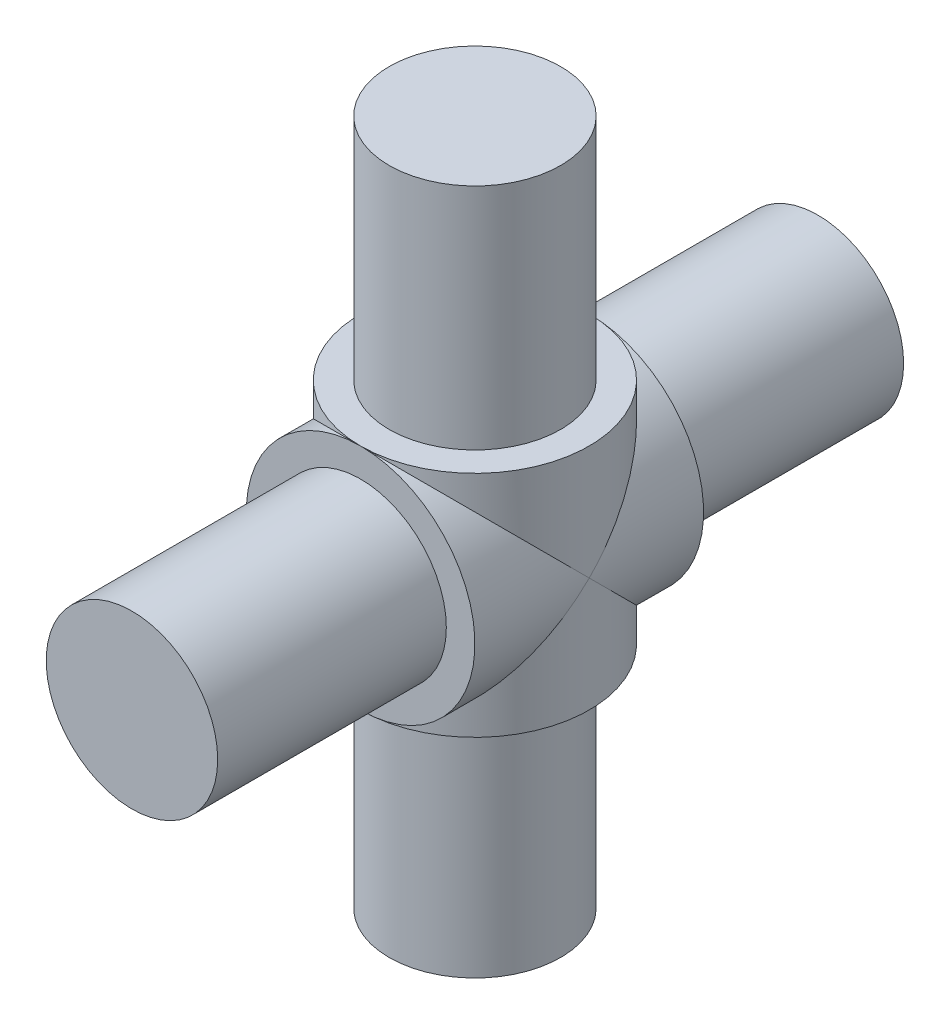
ISO-10303-21;
HEADER;
FILE_DESCRIPTION(('STEP AP214'),'2;1');
FILE_NAME('part.step','',(''),(''),'','','');
FILE_SCHEMA(('AUTOMOTIVE_DESIGN { 1 0 10303 214 1 1 1 1 }'));
ENDSEC;
DATA;
#1=APPLICATION_CONTEXT('core data for automotive mechanical design processes');
#2=APPLICATION_PROTOCOL_DEFINITION('international standard','automotive_design',2000,#1);
#3=PRODUCT_CONTEXT('',#1,'mechanical');
#4=PRODUCT('Part','Part','',(#3));
#5=PRODUCT_RELATED_PRODUCT_CATEGORY('part','',(#4));
#6=PRODUCT_DEFINITION_FORMATION('','',#4);
#7=PRODUCT_DEFINITION_CONTEXT('part definition',#1,'design');
#8=PRODUCT_DEFINITION('design','',#6,#7);
#9=PRODUCT_DEFINITION_SHAPE('','',#8);
#10=(LENGTH_UNIT() NAMED_UNIT(*) SI_UNIT(.MILLI.,.METRE.));
#11=(NAMED_UNIT(*) PLANE_ANGLE_UNIT() SI_UNIT($,.RADIAN.));
#12=(NAMED_UNIT(*) SI_UNIT($,.STERADIAN.) SOLID_ANGLE_UNIT());
#13=UNCERTAINTY_MEASURE_WITH_UNIT(LENGTH_MEASURE(1.E-05),#10,'distance_accuracy_value','');
#14=(GEOMETRIC_REPRESENTATION_CONTEXT(3) GLOBAL_UNCERTAINTY_ASSIGNED_CONTEXT((#13)) GLOBAL_UNIT_ASSIGNED_CONTEXT((#10,
#11,#12)) REPRESENTATION_CONTEXT('',''));
#15=CARTESIAN_POINT('',(0.,0.,0.));
#16=DIRECTION('',(0.,0.,1.));
#17=DIRECTION('',(1.,0.,0.));
#18=AXIS2_PLACEMENT_3D('',#15,#16,#17);
#19=CARTESIAN_POINT('',(0.,-10.,0.));
#20=DIRECTION('',(0.,1.,0.));
#21=DIRECTION('',(0.,0.,1.));
#22=AXIS2_PLACEMENT_3D('',#19,#20,#21);
#23=PLANE('',#22);
#24=CARTESIAN_POINT('',(0.,-10.,0.));
#25=DIRECTION('',(0.,1.,0.));
#26=DIRECTION('',(0.,0.,1.));
#27=AXIS2_PLACEMENT_3D('',#24,#25,#26);
#28=CIRCLE('',#27,10.);
#29=CARTESIAN_POINT('',(0.,-10.,10.));
#30=VERTEX_POINT('',#29);
#31=CARTESIAN_POINT('',(0.,-10.,-10.));
#32=VERTEX_POINT('',#31);
#33=EDGE_CURVE('E103',#30,#32,#28,.T.);
#34=ORIENTED_EDGE('',*,*,#33,.F.);
#35=EDGE_CURVE('E110',#32,#30,#28,.T.);
#36=ORIENTED_EDGE('',*,*,#35,.F.);
#37=EDGE_LOOP('',(#34,#36));
#38=FACE_BOUND('',#37,.T.);
#39=CARTESIAN_POINT('',(0.,-10.,0.));
#40=DIRECTION('',(0.,1.,0.));
#41=DIRECTION('',(0.,0.,1.));
#42=AXIS2_PLACEMENT_3D('',#39,#40,#41);
#43=CIRCLE('',#42,7.5);
#44=CARTESIAN_POINT('',(0.,-10.,7.5));
#45=VERTEX_POINT('',#44);
#46=EDGE_CURVE('E11',#45,#45,#43,.F.);
#47=ORIENTED_EDGE('',*,*,#46,.F.);
#48=EDGE_LOOP('',(#47));
#49=FACE_BOUND('',#48,.T.);
#50=ADVANCED_FACE('F32',(#38,#49),#23,.F.);
#51=CARTESIAN_POINT('',(0.,10.,0.));
#52=DIRECTION('',(0.,1.,0.));
#53=DIRECTION('',(0.,0.,1.));
#54=AXIS2_PLACEMENT_3D('',#51,#52,#53);
#55=PLANE('',#54);
#56=CARTESIAN_POINT('',(0.,10.,0.));
#57=DIRECTION('',(0.,1.,0.));
#58=DIRECTION('',(0.,0.,1.));
#59=AXIS2_PLACEMENT_3D('',#56,#57,#58);
#60=CIRCLE('',#59,10.);
#61=CARTESIAN_POINT('',(0.,10.,10.));
#62=VERTEX_POINT('',#61);
#63=CARTESIAN_POINT('',(0.,10.,-10.));
#64=VERTEX_POINT('',#63);
#65=EDGE_CURVE('E102',#62,#64,#60,.T.);
#66=ORIENTED_EDGE('',*,*,#65,.T.);
#67=EDGE_CURVE('E96',#64,#62,#60,.T.);
#68=ORIENTED_EDGE('',*,*,#67,.T.);
#69=EDGE_LOOP('',(#66,#68));
#70=FACE_BOUND('',#69,.T.);
#71=CARTESIAN_POINT('',(0.,10.,0.));
#72=DIRECTION('',(0.,1.,0.));
#73=DIRECTION('',(0.,0.,1.));
#74=AXIS2_PLACEMENT_3D('',#71,#72,#73);
#75=CIRCLE('',#74,7.5);
#76=CARTESIAN_POINT('',(0.,10.,7.5));
#77=VERTEX_POINT('',#76);
#78=EDGE_CURVE('E36',#77,#77,#75,.F.);
#79=ORIENTED_EDGE('',*,*,#78,.T.);
#80=EDGE_LOOP('',(#79));
#81=FACE_BOUND('',#80,.T.);
#82=ADVANCED_FACE('F100',(#70,#81),#55,.T.);
#83=CARTESIAN_POINT('',(0.,0.,10.));
#84=DIRECTION('',(0.,0.,-1.));
#85=DIRECTION('',(-1.,0.,0.));
#86=AXIS2_PLACEMENT_3D('',#83,#84,#85);
#87=CYLINDRICAL_SURFACE('',#86,10.);
#88=CARTESIAN_POINT('',(0.,0.,0.));
#89=DIRECTION('',(0.,-0.707106781186547,-0.707106781186547));
#90=DIRECTION('',(0.,0.707106781186547,-0.707106781186547));
#91=AXIS2_PLACEMENT_3D('',#88,#89,#90);
#92=ELLIPSE('',#91,14.1421356237309,10.);
#93=CARTESIAN_POINT('',(10.,0.,0.));
#94=VERTEX_POINT('',#93);
#95=EDGE_CURVE('E77',#94,#30,#92,.T.);
#96=ORIENTED_EDGE('',*,*,#95,.F.);
#97=CARTESIAN_POINT('',(0.,0.,0.));
#98=DIRECTION('',(0.,0.707106781186547,-0.707106781186547));
#99=DIRECTION('',(0.,-0.707106781186547,-0.707106781186547));
#100=AXIS2_PLACEMENT_3D('',#97,#98,#99);
#101=ELLIPSE('',#100,14.1421356237309,10.);
#102=EDGE_CURVE('E72',#62,#94,#101,.T.);
#103=ORIENTED_EDGE('',*,*,#102,.F.);
#104=CARTESIAN_POINT('',(0.,0.,10.));
#105=DIRECTION('',(0.,0.,1.));
#106=DIRECTION('',(1.,0.,0.));
#107=AXIS2_PLACEMENT_3D('',#104,#105,#106);
#108=CIRCLE('',#107,10.);
#109=EDGE_CURVE('E75',#30,#62,#108,.T.);
#110=ORIENTED_EDGE('',*,*,#109,.F.);
#111=EDGE_LOOP('',(#96,#103,#110));
#112=FACE_BOUND('',#111,.T.);
#113=ADVANCED_FACE('F74',(#112),#87,.T.);
#114=CARTESIAN_POINT('',(-10.,0.,0.));
#115=VERTEX_POINT('',#114);
#116=EDGE_CURVE('E90',#30,#115,#92,.T.);
#117=ORIENTED_EDGE('',*,*,#116,.F.);
#118=EDGE_CURVE('E85',#62,#30,#108,.T.);
#119=ORIENTED_EDGE('',*,*,#118,.F.);
#120=EDGE_CURVE('E57',#115,#62,#101,.T.);
#121=ORIENTED_EDGE('',*,*,#120,.F.);
#122=EDGE_LOOP('',(#117,#119,#121));
#123=FACE_BOUND('',#122,.T.);
#124=ADVANCED_FACE('F88',(#123),#87,.T.);
#125=CARTESIAN_POINT('',(0.,0.,10.));
#126=DIRECTION('',(0.,0.,1.));
#127=DIRECTION('',(1.,0.,0.));
#128=AXIS2_PLACEMENT_3D('',#125,#126,#127);
#129=PLANE('',#128);
#130=CARTESIAN_POINT('',(0.,0.,10.));
#131=DIRECTION('',(0.,0.,1.));
#132=DIRECTION('',(1.,0.,0.));
#133=AXIS2_PLACEMENT_3D('',#130,#131,#132);
#134=CIRCLE('',#133,7.5);
#135=CARTESIAN_POINT('',(7.5,0.,10.));
#136=VERTEX_POINT('',#135);
#137=EDGE_CURVE('E117',#136,#136,#134,.F.);
#138=ORIENTED_EDGE('',*,*,#137,.T.);
#139=EDGE_LOOP('',(#138));
#140=FACE_BOUND('',#139,.T.);
#141=ORIENTED_EDGE('',*,*,#118,.T.);
#142=ORIENTED_EDGE('',*,*,#109,.T.);
#143=EDGE_LOOP('',(#141,#142));
#144=FACE_BOUND('',#143,.T.);
#145=ADVANCED_FACE('F84',(#140,#144),#129,.T.);
#146=CARTESIAN_POINT('',(0.,0.,30.));
#147=DIRECTION('',(0.,0.,-1.));
#148=DIRECTION('',(-1.,0.,0.));
#149=AXIS2_PLACEMENT_3D('',#146,#147,#148);
#150=CYLINDRICAL_SURFACE('',#149,7.5);
#151=ORIENTED_EDGE('',*,*,#137,.F.);
#152=EDGE_LOOP('',(#151));
#153=FACE_BOUND('',#152,.T.);
#154=CARTESIAN_POINT('',(0.,0.,30.));
#155=DIRECTION('',(0.,0.,1.));
#156=DIRECTION('',(1.,0.,0.));
#157=AXIS2_PLACEMENT_3D('',#154,#155,#156);
#158=CIRCLE('',#157,7.5);
#159=CARTESIAN_POINT('',(7.5,0.,30.));
#160=VERTEX_POINT('',#159);
#161=EDGE_CURVE('E114',#160,#160,#158,.T.);
#162=ORIENTED_EDGE('',*,*,#161,.F.);
#163=EDGE_LOOP('',(#162));
#164=FACE_BOUND('',#163,.T.);
#165=ADVANCED_FACE('F156',(#153,#164),#150,.T.);
#166=CARTESIAN_POINT('',(0.,0.,30.));
#167=DIRECTION('',(0.,0.,1.));
#168=DIRECTION('',(1.,0.,0.));
#169=AXIS2_PLACEMENT_3D('',#166,#167,#168);
#170=PLANE('',#169);
#171=ORIENTED_EDGE('',*,*,#161,.T.);
#172=EDGE_LOOP('',(#171));
#173=FACE_BOUND('',#172,.T.);
#174=ADVANCED_FACE('F149',(#173),#170,.T.);
#175=CARTESIAN_POINT('',(0.,10.,0.));
#176=DIRECTION('',(0.,-1.,0.));
#177=DIRECTION('',(0.,0.,-1.));
#178=AXIS2_PLACEMENT_3D('',#175,#176,#177);
#179=CYLINDRICAL_SURFACE('',#178,10.);
#180=CARTESIAN_POINT('',(0.,0.,0.));
#181=DIRECTION('',(0.,0.707106781186547,-0.707106781186547));
#182=DIRECTION('',(0.,-0.707106781186547,-0.707106781186547));
#183=AXIS2_PLACEMENT_3D('',#180,#181,#182);
#184=ELLIPSE('',#183,14.1421356237309,10.);
#185=EDGE_CURVE('E49',#32,#94,#184,.F.);
#186=ORIENTED_EDGE('',*,*,#185,.T.);
#187=ORIENTED_EDGE('',*,*,#95,.T.);
#188=ORIENTED_EDGE('',*,*,#33,.T.);
#189=EDGE_LOOP('',(#186,#187,#188));
#190=FACE_BOUND('',#189,.T.);
#191=ADVANCED_FACE('F147',(#190),#179,.T.);
#192=ORIENTED_EDGE('',*,*,#35,.T.);
#193=ORIENTED_EDGE('',*,*,#116,.T.);
#194=EDGE_CURVE('E81',#115,#32,#184,.F.);
#195=ORIENTED_EDGE('',*,*,#194,.T.);
#196=EDGE_LOOP('',(#192,#193,#195));
#197=FACE_BOUND('',#196,.T.);
#198=ADVANCED_FACE('F143',(#197),#179,.T.);
#199=CARTESIAN_POINT('',(0.,0.,-30.));
#200=DIRECTION('',(0.,0.,1.));
#201=DIRECTION('',(1.,0.,0.));
#202=AXIS2_PLACEMENT_3D('',#199,#200,#201);
#203=PLANE('',#202);
#204=CARTESIAN_POINT('',(0.,0.,-30.));
#205=DIRECTION('',(0.,0.,1.));
#206=DIRECTION('',(1.,0.,0.));
#207=AXIS2_PLACEMENT_3D('',#204,#205,#206);
#208=CIRCLE('',#207,7.5);
#209=CARTESIAN_POINT('',(7.5,0.,-30.));
#210=VERTEX_POINT('',#209);
#211=EDGE_CURVE('E118',#210,#210,#208,.T.);
#212=ORIENTED_EDGE('',*,*,#211,.F.);
#213=EDGE_LOOP('',(#212));
#214=FACE_BOUND('',#213,.T.);
#215=ADVANCED_FACE('F155',(#214),#203,.F.);
#216=ORIENTED_EDGE('',*,*,#211,.T.);
#217=EDGE_LOOP('',(#216));
#218=FACE_BOUND('',#217,.T.);
#219=CARTESIAN_POINT('',(0.,0.,-10.));
#220=DIRECTION('',(0.,0.,1.));
#221=DIRECTION('',(1.,0.,0.));
#222=AXIS2_PLACEMENT_3D('',#219,#220,#221);
#223=CIRCLE('',#222,7.5);
#224=CARTESIAN_POINT('',(7.5,0.,-10.));
#225=VERTEX_POINT('',#224);
#226=EDGE_CURVE('E41',#225,#225,#223,.F.);
#227=ORIENTED_EDGE('',*,*,#226,.T.);
#228=EDGE_LOOP('',(#227));
#229=FACE_BOUND('',#228,.T.);
#230=ADVANCED_FACE('F128',(#218,#229),#150,.T.);
#231=CARTESIAN_POINT('',(0.,0.,-10.));
#232=DIRECTION('',(0.,0.,1.));
#233=DIRECTION('',(1.,0.,0.));
#234=AXIS2_PLACEMENT_3D('',#231,#232,#233);
#235=PLANE('',#234);
#236=ORIENTED_EDGE('',*,*,#226,.F.);
#237=EDGE_LOOP('',(#236));
#238=FACE_BOUND('',#237,.T.);
#239=CARTESIAN_POINT('',(0.,0.,-10.));
#240=DIRECTION('',(0.,0.,1.));
#241=DIRECTION('',(1.,0.,0.));
#242=AXIS2_PLACEMENT_3D('',#239,#240,#241);
#243=CIRCLE('',#242,10.);
#244=EDGE_CURVE('E122',#32,#64,#243,.T.);
#245=ORIENTED_EDGE('',*,*,#244,.F.);
#246=EDGE_CURVE('E86',#64,#32,#243,.T.);
#247=ORIENTED_EDGE('',*,*,#246,.F.);
#248=EDGE_LOOP('',(#245,#247));
#249=FACE_BOUND('',#248,.T.);
#250=ADVANCED_FACE('F130',(#238,#249),#235,.F.);
#251=CARTESIAN_POINT('',(0.,0.,0.));
#252=DIRECTION('',(0.,-0.707106781186547,-0.707106781186547));
#253=DIRECTION('',(0.,0.707106781186547,-0.707106781186547));
#254=AXIS2_PLACEMENT_3D('',#251,#252,#253);
#255=ELLIPSE('',#254,14.1421356237309,10.);
#256=EDGE_CURVE('E106',#94,#64,#255,.F.);
#257=ORIENTED_EDGE('',*,*,#256,.F.);
#258=ORIENTED_EDGE('',*,*,#185,.F.);
#259=ORIENTED_EDGE('',*,*,#244,.T.);
#260=EDGE_LOOP('',(#257,#258,#259));
#261=FACE_BOUND('',#260,.T.);
#262=ADVANCED_FACE('F133',(#261),#87,.T.);
#263=ORIENTED_EDGE('',*,*,#194,.F.);
#264=EDGE_CURVE('E98',#64,#115,#255,.F.);
#265=ORIENTED_EDGE('',*,*,#264,.F.);
#266=ORIENTED_EDGE('',*,*,#246,.T.);
#267=EDGE_LOOP('',(#263,#265,#266));
#268=FACE_BOUND('',#267,.T.);
#269=ADVANCED_FACE('F34',(#268),#87,.T.);
#270=ORIENTED_EDGE('',*,*,#67,.F.);
#271=ORIENTED_EDGE('',*,*,#264,.T.);
#272=ORIENTED_EDGE('',*,*,#120,.T.);
#273=EDGE_LOOP('',(#270,#271,#272));
#274=FACE_BOUND('',#273,.T.);
#275=ADVANCED_FACE('F95',(#274),#179,.T.);
#276=ORIENTED_EDGE('',*,*,#102,.T.);
#277=ORIENTED_EDGE('',*,*,#256,.T.);
#278=ORIENTED_EDGE('',*,*,#65,.F.);
#279=EDGE_LOOP('',(#276,#277,#278));
#280=FACE_BOUND('',#279,.T.);
#281=ADVANCED_FACE('F105',(#280),#179,.T.);
#282=CARTESIAN_POINT('',(0.,30.,0.));
#283=DIRECTION('',(0.,1.,0.));
#284=DIRECTION('',(0.,0.,1.));
#285=AXIS2_PLACEMENT_3D('',#282,#283,#284);
#286=PLANE('',#285);
#287=CARTESIAN_POINT('',(0.,30.,0.));
#288=DIRECTION('',(0.,1.,0.));
#289=DIRECTION('',(0.,0.,1.));
#290=AXIS2_PLACEMENT_3D('',#287,#288,#289);
#291=CIRCLE('',#290,7.5);
#292=CARTESIAN_POINT('',(0.,30.,7.5));
#293=VERTEX_POINT('',#292);
#294=EDGE_CURVE('E183',#293,#293,#291,.T.);
#295=ORIENTED_EDGE('',*,*,#294,.T.);
#296=EDGE_LOOP('',(#295));
#297=FACE_BOUND('',#296,.T.);
#298=ADVANCED_FACE('F161',(#297),#286,.T.);
#299=CARTESIAN_POINT('',(0.,30.,0.));
#300=DIRECTION('',(0.,-1.,0.));
#301=DIRECTION('',(0.,0.,-1.));
#302=AXIS2_PLACEMENT_3D('',#299,#300,#301);
#303=CYLINDRICAL_SURFACE('',#302,7.5);
#304=ORIENTED_EDGE('',*,*,#78,.F.);
#305=EDGE_LOOP('',(#304));
#306=FACE_BOUND('',#305,.T.);
#307=ORIENTED_EDGE('',*,*,#294,.F.);
#308=EDGE_LOOP('',(#307));
#309=FACE_BOUND('',#308,.T.);
#310=ADVANCED_FACE('F168',(#306,#309),#303,.T.);
#311=CARTESIAN_POINT('',(0.,-30.,0.));
#312=DIRECTION('',(0.,1.,0.));
#313=DIRECTION('',(0.,0.,1.));
#314=AXIS2_PLACEMENT_3D('',#311,#312,#313);
#315=CIRCLE('',#314,7.5);
#316=CARTESIAN_POINT('',(0.,-30.,7.5));
#317=VERTEX_POINT('',#316);
#318=EDGE_CURVE('E185',#317,#317,#315,.T.);
#319=ORIENTED_EDGE('',*,*,#318,.T.);
#320=EDGE_LOOP('',(#319));
#321=FACE_BOUND('',#320,.T.);
#322=ORIENTED_EDGE('',*,*,#46,.T.);
#323=EDGE_LOOP('',(#322));
#324=FACE_BOUND('',#323,.T.);
#325=ADVANCED_FACE('F171',(#321,#324),#303,.T.);
#326=CARTESIAN_POINT('',(0.,-30.,0.));
#327=DIRECTION('',(0.,1.,0.));
#328=DIRECTION('',(0.,0.,1.));
#329=AXIS2_PLACEMENT_3D('',#326,#327,#328);
#330=PLANE('',#329);
#331=ORIENTED_EDGE('',*,*,#318,.F.);
#332=EDGE_LOOP('',(#331));
#333=FACE_BOUND('',#332,.T.);
#334=ADVANCED_FACE('F173',(#333),#330,.F.);
#335=CLOSED_SHELL('',(#50,#82,#113,#124,#145,#165,#174,#191,#198,#215,#230,#250,#262,#269,#275,
#281,#298,#310,#325,#334));
#336=MANIFOLD_SOLID_BREP('B2',#335);
#337=ADVANCED_BREP_SHAPE_REPRESENTATION('',(#18,#336),#14);
#338=SHAPE_DEFINITION_REPRESENTATION(#9,#337);
ENDSEC;
END-ISO-10303-21;
